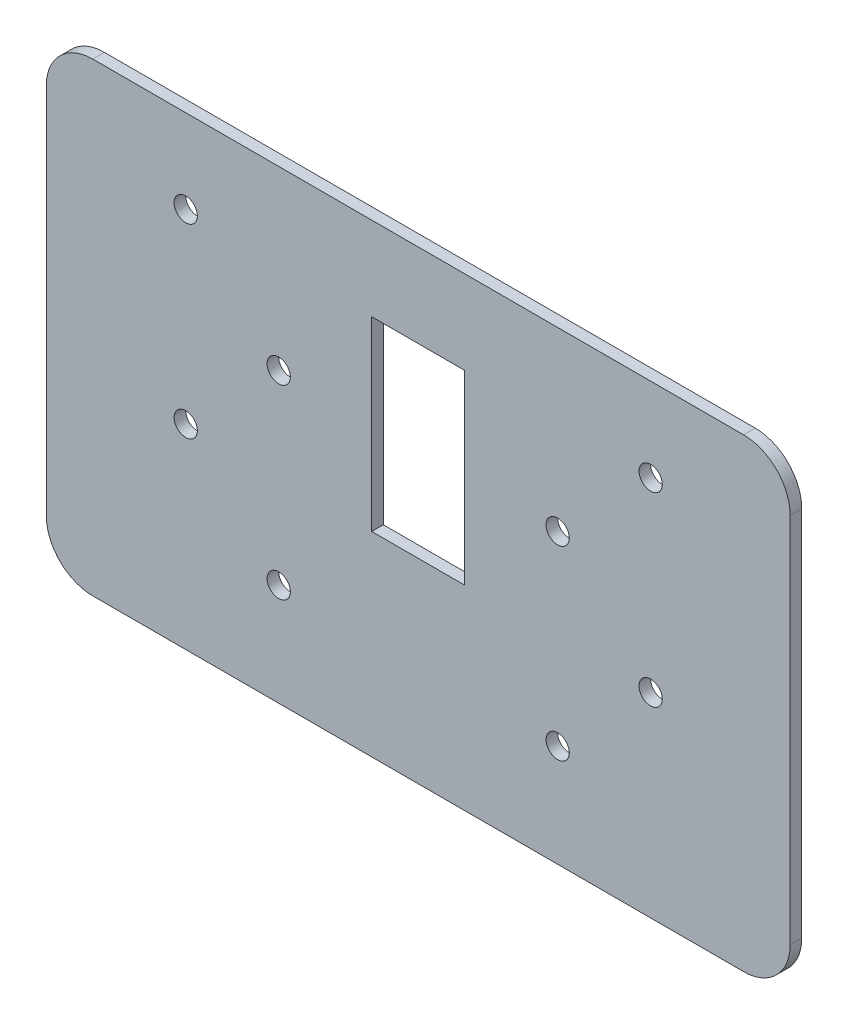
ISO-10303-21;
HEADER;
FILE_DESCRIPTION(('STEP AP214'),'2;1');
FILE_NAME('part.step','',(''),(''),'','','');
FILE_SCHEMA(('AUTOMOTIVE_DESIGN { 1 0 10303 214 1 1 1 1 }'));
ENDSEC;
DATA;
#1=APPLICATION_CONTEXT('core data for automotive mechanical design processes');
#2=APPLICATION_PROTOCOL_DEFINITION('international standard','automotive_design',2000,#1);
#3=PRODUCT_CONTEXT('',#1,'mechanical');
#4=PRODUCT('Part','Part','',(#3));
#5=PRODUCT_RELATED_PRODUCT_CATEGORY('part','',(#4));
#6=PRODUCT_DEFINITION_FORMATION('','',#4);
#7=PRODUCT_DEFINITION_CONTEXT('part definition',#1,'design');
#8=PRODUCT_DEFINITION('design','',#6,#7);
#9=PRODUCT_DEFINITION_SHAPE('','',#8);
#10=(LENGTH_UNIT() NAMED_UNIT(*) SI_UNIT(.MILLI.,.METRE.));
#11=(NAMED_UNIT(*) PLANE_ANGLE_UNIT() SI_UNIT($,.RADIAN.));
#12=(NAMED_UNIT(*) SI_UNIT($,.STERADIAN.) SOLID_ANGLE_UNIT());
#13=UNCERTAINTY_MEASURE_WITH_UNIT(LENGTH_MEASURE(1.E-05),#10,'distance_accuracy_value','');
#14=(GEOMETRIC_REPRESENTATION_CONTEXT(3) GLOBAL_UNCERTAINTY_ASSIGNED_CONTEXT((#13)) GLOBAL_UNIT_ASSIGNED_CONTEXT((#10,
#11,#12)) REPRESENTATION_CONTEXT('',''));
#15=CARTESIAN_POINT('',(0.,0.,0.));
#16=DIRECTION('',(0.,0.,1.));
#17=DIRECTION('',(1.,0.,0.));
#18=AXIS2_PLACEMENT_3D('',#15,#16,#17);
#19=CARTESIAN_POINT('',(0.,454.630831077748,3.175));
#20=DIRECTION('',(0.,1.,0.));
#21=DIRECTION('',(0.,0.,1.));
#22=AXIS2_PLACEMENT_3D('',#19,#20,#21);
#23=PLANE('',#22);
#24=DIRECTION('',(1.,0.,0.));
#25=VECTOR('',#24,1.);
#26=CARTESIAN_POINT('',(0.,454.630831077748,0.));
#27=LINE('',#26,#25);
#28=CARTESIAN_POINT('',(214.219369125784,454.630831077748,0.));
#29=VERTEX_POINT('',#28);
#30=CARTESIAN_POINT('',(392.019369125783,454.630831077748,0.));
#31=VERTEX_POINT('',#30);
#32=EDGE_CURVE('E196',#29,#31,#27,.T.);
#33=ORIENTED_EDGE('',*,*,#32,.F.);
#34=DIRECTION('',(0.,0.,-1.));
#35=VECTOR('',#34,1.);
#36=CARTESIAN_POINT('',(214.219369125784,454.630831077748,3.175));
#37=LINE('',#36,#35);
#38=CARTESIAN_POINT('',(214.219369125784,454.630831077748,3.175));
#39=VERTEX_POINT('',#38);
#40=EDGE_CURVE('E11',#39,#29,#37,.T.);
#41=ORIENTED_EDGE('',*,*,#40,.F.);
#42=DIRECTION('',(1.,0.,0.));
#43=VECTOR('',#42,1.);
#44=CARTESIAN_POINT('',(0.,454.630831077748,3.175));
#45=LINE('',#44,#43);
#46=CARTESIAN_POINT('',(392.019369125783,454.630831077748,3.175));
#47=VERTEX_POINT('',#46);
#48=EDGE_CURVE('E282',#39,#47,#45,.T.);
#49=ORIENTED_EDGE('',*,*,#48,.T.);
#50=DIRECTION('',(0.,0.,-1.));
#51=VECTOR('',#50,1.);
#52=CARTESIAN_POINT('',(392.019369125783,454.630831077748,3.175));
#53=LINE('',#52,#51);
#54=EDGE_CURVE('E54',#47,#31,#53,.T.);
#55=ORIENTED_EDGE('',*,*,#54,.T.);
#56=EDGE_LOOP('',(#33,#41,#49,#55));
#57=FACE_BOUND('',#56,.T.);
#58=ADVANCED_FACE('F35',(#57),#23,.T.);
#59=CARTESIAN_POINT('',(214.219369125784,441.930831077748,3.175));
#60=DIRECTION('',(0.,0.,-1.));
#61=DIRECTION('',(-1.,0.,0.));
#62=AXIS2_PLACEMENT_3D('',#59,#60,#61);
#63=CYLINDRICAL_SURFACE('',#62,12.7);
#64=CARTESIAN_POINT('',(214.219369125784,441.930831077748,0.));
#65=DIRECTION('',(0.,0.,1.));
#66=DIRECTION('',(1.,0.,0.));
#67=AXIS2_PLACEMENT_3D('',#64,#65,#66);
#68=CIRCLE('',#67,12.7);
#69=CARTESIAN_POINT('',(201.519369125784,441.930831077748,0.));
#70=VERTEX_POINT('',#69);
#71=EDGE_CURVE('E198',#29,#70,#68,.T.);
#72=ORIENTED_EDGE('',*,*,#71,.T.);
#73=DIRECTION('',(0.,0.,-1.));
#74=VECTOR('',#73,1.);
#75=CARTESIAN_POINT('',(201.519369125784,441.930831077748,3.175));
#76=LINE('',#75,#74);
#77=CARTESIAN_POINT('',(201.519369125784,441.930831077748,3.175));
#78=VERTEX_POINT('',#77);
#79=EDGE_CURVE('E45',#78,#70,#76,.T.);
#80=ORIENTED_EDGE('',*,*,#79,.F.);
#81=CARTESIAN_POINT('',(214.219369125784,441.930831077748,3.175));
#82=DIRECTION('',(0.,0.,1.));
#83=DIRECTION('',(1.,0.,0.));
#84=AXIS2_PLACEMENT_3D('',#81,#82,#83);
#85=CIRCLE('',#84,12.7);
#86=EDGE_CURVE('E284',#39,#78,#85,.T.);
#87=ORIENTED_EDGE('',*,*,#86,.F.);
#88=ORIENTED_EDGE('',*,*,#40,.T.);
#89=EDGE_LOOP('',(#72,#80,#87,#88));
#90=FACE_BOUND('',#89,.T.);
#91=ADVANCED_FACE('F317',(#90),#63,.T.);
#92=CARTESIAN_POINT('',(201.519369125784,0.,3.175));
#93=DIRECTION('',(1.,0.,0.));
#94=DIRECTION('',(0.,1.,0.));
#95=AXIS2_PLACEMENT_3D('',#92,#93,#94);
#96=PLANE('',#95);
#97=DIRECTION('',(0.,-1.,0.));
#98=VECTOR('',#97,1.);
#99=CARTESIAN_POINT('',(201.519369125784,0.,0.));
#100=LINE('',#99,#98);
#101=CARTESIAN_POINT('',(201.519369125784,340.330831077748,0.));
#102=VERTEX_POINT('',#101);
#103=EDGE_CURVE('E201',#70,#102,#100,.T.);
#104=ORIENTED_EDGE('',*,*,#103,.T.);
#105=DIRECTION('',(0.,0.,-1.));
#106=VECTOR('',#105,1.);
#107=CARTESIAN_POINT('',(201.519369125784,340.330831077748,3.175));
#108=LINE('',#107,#106);
#109=CARTESIAN_POINT('',(201.519369125784,340.330831077748,3.175));
#110=VERTEX_POINT('',#109);
#111=EDGE_CURVE('E235',#110,#102,#108,.T.);
#112=ORIENTED_EDGE('',*,*,#111,.F.);
#113=DIRECTION('',(0.,-1.,0.));
#114=VECTOR('',#113,1.);
#115=CARTESIAN_POINT('',(201.519369125784,0.,3.175));
#116=LINE('',#115,#114);
#117=EDGE_CURVE('E287',#78,#110,#116,.T.);
#118=ORIENTED_EDGE('',*,*,#117,.F.);
#119=ORIENTED_EDGE('',*,*,#79,.T.);
#120=EDGE_LOOP('',(#104,#112,#118,#119));
#121=FACE_BOUND('',#120,.T.);
#122=ADVANCED_FACE('F322',(#121),#96,.F.);
#123=CARTESIAN_POINT('',(214.219369125784,340.330831077748,3.175));
#124=DIRECTION('',(0.,0.,-1.));
#125=DIRECTION('',(-1.,0.,0.));
#126=AXIS2_PLACEMENT_3D('',#123,#124,#125);
#127=CYLINDRICAL_SURFACE('',#126,12.7);
#128=CARTESIAN_POINT('',(214.219369125784,340.330831077748,0.));
#129=DIRECTION('',(0.,0.,1.));
#130=DIRECTION('',(1.,0.,0.));
#131=AXIS2_PLACEMENT_3D('',#128,#129,#130);
#132=CIRCLE('',#131,12.7);
#133=CARTESIAN_POINT('',(214.219369125784,327.630831077748,0.));
#134=VERTEX_POINT('',#133);
#135=EDGE_CURVE('E204',#102,#134,#132,.T.);
#136=ORIENTED_EDGE('',*,*,#135,.T.);
#137=DIRECTION('',(0.,0.,-1.));
#138=VECTOR('',#137,1.);
#139=CARTESIAN_POINT('',(214.219369125784,327.630831077748,3.175));
#140=LINE('',#139,#138);
#141=CARTESIAN_POINT('',(214.219369125784,327.630831077748,3.175));
#142=VERTEX_POINT('',#141);
#143=EDGE_CURVE('E232',#142,#134,#140,.T.);
#144=ORIENTED_EDGE('',*,*,#143,.F.);
#145=CARTESIAN_POINT('',(214.219369125784,340.330831077748,3.175));
#146=DIRECTION('',(0.,0.,1.));
#147=DIRECTION('',(1.,0.,0.));
#148=AXIS2_PLACEMENT_3D('',#145,#146,#147);
#149=CIRCLE('',#148,12.7);
#150=EDGE_CURVE('E290',#110,#142,#149,.T.);
#151=ORIENTED_EDGE('',*,*,#150,.F.);
#152=ORIENTED_EDGE('',*,*,#111,.T.);
#153=EDGE_LOOP('',(#136,#144,#151,#152));
#154=FACE_BOUND('',#153,.T.);
#155=ADVANCED_FACE('F294',(#154),#127,.T.);
#156=CARTESIAN_POINT('',(0.,327.630831077748,3.175));
#157=DIRECTION('',(0.,1.,0.));
#158=DIRECTION('',(0.,0.,1.));
#159=AXIS2_PLACEMENT_3D('',#156,#157,#158);
#160=PLANE('',#159);
#161=DIRECTION('',(1.,0.,0.));
#162=VECTOR('',#161,1.);
#163=CARTESIAN_POINT('',(0.,327.630831077748,0.));
#164=LINE('',#163,#162);
#165=CARTESIAN_POINT('',(392.019369125783,327.630831077748,0.));
#166=VERTEX_POINT('',#165);
#167=EDGE_CURVE('E207',#134,#166,#164,.T.);
#168=ORIENTED_EDGE('',*,*,#167,.T.);
#169=DIRECTION('',(0.,0.,-1.));
#170=VECTOR('',#169,1.);
#171=CARTESIAN_POINT('',(392.019369125783,327.630831077748,3.175));
#172=LINE('',#171,#170);
#173=CARTESIAN_POINT('',(392.019369125783,327.630831077748,3.175));
#174=VERTEX_POINT('',#173);
#175=EDGE_CURVE('E151',#174,#166,#172,.T.);
#176=ORIENTED_EDGE('',*,*,#175,.F.);
#177=DIRECTION('',(1.,0.,0.));
#178=VECTOR('',#177,1.);
#179=CARTESIAN_POINT('',(0.,327.630831077748,3.175));
#180=LINE('',#179,#178);
#181=EDGE_CURVE('E140',#142,#174,#180,.T.);
#182=ORIENTED_EDGE('',*,*,#181,.F.);
#183=ORIENTED_EDGE('',*,*,#143,.T.);
#184=EDGE_LOOP('',(#168,#176,#182,#183));
#185=FACE_BOUND('',#184,.T.);
#186=ADVANCED_FACE('F296',(#185),#160,.F.);
#187=CARTESIAN_POINT('',(392.019369125784,340.330831077748,3.175));
#188=DIRECTION('',(0.,0.,-1.));
#189=DIRECTION('',(-1.,0.,0.));
#190=AXIS2_PLACEMENT_3D('',#187,#188,#189);
#191=CYLINDRICAL_SURFACE('',#190,12.7);
#192=CARTESIAN_POINT('',(392.019369125784,340.330831077748,0.));
#193=DIRECTION('',(0.,0.,1.));
#194=DIRECTION('',(1.,0.,0.));
#195=AXIS2_PLACEMENT_3D('',#192,#193,#194);
#196=CIRCLE('',#195,12.7);
#197=CARTESIAN_POINT('',(404.719369125784,340.330831077748,0.));
#198=VERTEX_POINT('',#197);
#199=EDGE_CURVE('E148',#166,#198,#196,.T.);
#200=ORIENTED_EDGE('',*,*,#199,.T.);
#201=DIRECTION('',(0.,0.,-1.));
#202=VECTOR('',#201,1.);
#203=CARTESIAN_POINT('',(404.719369125784,340.330831077748,3.175));
#204=LINE('',#203,#202);
#205=CARTESIAN_POINT('',(404.719369125784,340.330831077748,3.175));
#206=VERTEX_POINT('',#205);
#207=EDGE_CURVE('E146',#206,#198,#204,.T.);
#208=ORIENTED_EDGE('',*,*,#207,.F.);
#209=CARTESIAN_POINT('',(392.019369125784,340.330831077748,3.175));
#210=DIRECTION('',(0.,0.,1.));
#211=DIRECTION('',(1.,0.,0.));
#212=AXIS2_PLACEMENT_3D('',#209,#210,#211);
#213=CIRCLE('',#212,12.7);
#214=EDGE_CURVE('E131',#174,#206,#213,.T.);
#215=ORIENTED_EDGE('',*,*,#214,.F.);
#216=ORIENTED_EDGE('',*,*,#175,.T.);
#217=EDGE_LOOP('',(#200,#208,#215,#216));
#218=FACE_BOUND('',#217,.T.);
#219=ADVANCED_FACE('F147',(#218),#191,.T.);
#220=CARTESIAN_POINT('',(404.719369125784,0.,3.175));
#221=DIRECTION('',(1.,0.,0.));
#222=DIRECTION('',(0.,0.,-1.));
#223=AXIS2_PLACEMENT_3D('',#220,#221,#222);
#224=PLANE('',#223);
#225=DIRECTION('',(0.,-1.,0.));
#226=VECTOR('',#225,1.);
#227=CARTESIAN_POINT('',(404.719369125784,0.,0.));
#228=LINE('',#227,#226);
#229=CARTESIAN_POINT('',(404.719369125784,441.930831077748,0.));
#230=VERTEX_POINT('',#229);
#231=EDGE_CURVE('E211',#230,#198,#228,.T.);
#232=ORIENTED_EDGE('',*,*,#231,.F.);
#233=DIRECTION('',(0.,0.,-1.));
#234=VECTOR('',#233,1.);
#235=CARTESIAN_POINT('',(404.719369125784,441.930831077748,3.175));
#236=LINE('',#235,#234);
#237=CARTESIAN_POINT('',(404.719369125784,441.930831077748,3.175));
#238=VERTEX_POINT('',#237);
#239=EDGE_CURVE('E91',#238,#230,#236,.T.);
#240=ORIENTED_EDGE('',*,*,#239,.F.);
#241=DIRECTION('',(0.,-1.,0.));
#242=VECTOR('',#241,1.);
#243=CARTESIAN_POINT('',(404.719369125784,0.,3.175));
#244=LINE('',#243,#242);
#245=EDGE_CURVE('E138',#238,#206,#244,.T.);
#246=ORIENTED_EDGE('',*,*,#245,.T.);
#247=ORIENTED_EDGE('',*,*,#207,.T.);
#248=EDGE_LOOP('',(#232,#240,#246,#247));
#249=FACE_BOUND('',#248,.T.);
#250=ADVANCED_FACE('F153',(#249),#224,.T.);
#251=CARTESIAN_POINT('',(290.419369125784,0.,3.175));
#252=DIRECTION('',(1.,0.,0.));
#253=DIRECTION('',(0.,0.,-1.));
#254=AXIS2_PLACEMENT_3D('',#251,#252,#253);
#255=PLANE('',#254);
#256=DIRECTION('',(0.,-1.,0.));
#257=VECTOR('',#256,1.);
#258=CARTESIAN_POINT('',(290.419369125784,0.,0.));
#259=LINE('',#258,#257);
#260=CARTESIAN_POINT('',(290.419369125784,431.770831077748,0.));
#261=VERTEX_POINT('',#260);
#262=CARTESIAN_POINT('',(290.419369125784,380.970831077748,0.));
#263=VERTEX_POINT('',#262);
#264=EDGE_CURVE('E172',#261,#263,#259,.T.);
#265=ORIENTED_EDGE('',*,*,#264,.F.);
#266=DIRECTION('',(0.,0.,-1.));
#267=VECTOR('',#266,1.);
#268=CARTESIAN_POINT('',(290.419369125784,431.770831077748,3.175));
#269=LINE('',#268,#267);
#270=CARTESIAN_POINT('',(290.419369125784,431.770831077748,3.175));
#271=VERTEX_POINT('',#270);
#272=EDGE_CURVE('E39',#271,#261,#269,.T.);
#273=ORIENTED_EDGE('',*,*,#272,.F.);
#274=DIRECTION('',(0.,-1.,0.));
#275=VECTOR('',#274,1.);
#276=CARTESIAN_POINT('',(290.419369125784,0.,3.175));
#277=LINE('',#276,#275);
#278=CARTESIAN_POINT('',(290.419369125784,380.970831077748,3.175));
#279=VERTEX_POINT('',#278);
#280=EDGE_CURVE('E228',#271,#279,#277,.T.);
#281=ORIENTED_EDGE('',*,*,#280,.T.);
#282=DIRECTION('',(0.,0.,-1.));
#283=VECTOR('',#282,1.);
#284=CARTESIAN_POINT('',(290.419369125784,380.970831077748,3.175));
#285=LINE('',#284,#283);
#286=EDGE_CURVE('E171',#279,#263,#285,.T.);
#287=ORIENTED_EDGE('',*,*,#286,.T.);
#288=EDGE_LOOP('',(#265,#273,#281,#287));
#289=FACE_BOUND('',#288,.T.);
#290=ADVANCED_FACE('F37',(#289),#255,.T.);
#291=CARTESIAN_POINT('',(0.,431.770831077748,3.175));
#292=DIRECTION('',(0.,-1.,0.));
#293=DIRECTION('',(0.,0.,-1.));
#294=AXIS2_PLACEMENT_3D('',#291,#292,#293);
#295=PLANE('',#294);
#296=DIRECTION('',(-1.,0.,0.));
#297=VECTOR('',#296,1.);
#298=CARTESIAN_POINT('',(0.,431.770831077748,0.));
#299=LINE('',#298,#297);
#300=CARTESIAN_POINT('',(315.819369125784,431.770831077748,0.));
#301=VERTEX_POINT('',#300);
#302=EDGE_CURVE('E175',#301,#261,#299,.T.);
#303=ORIENTED_EDGE('',*,*,#302,.F.);
#304=DIRECTION('',(0.,0.,-1.));
#305=VECTOR('',#304,1.);
#306=CARTESIAN_POINT('',(315.819369125784,431.770831077748,3.175));
#307=LINE('',#306,#305);
#308=CARTESIAN_POINT('',(315.819369125784,431.770831077748,3.175));
#309=VERTEX_POINT('',#308);
#310=EDGE_CURVE('E242',#309,#301,#307,.T.);
#311=ORIENTED_EDGE('',*,*,#310,.F.);
#312=DIRECTION('',(-1.,0.,0.));
#313=VECTOR('',#312,1.);
#314=CARTESIAN_POINT('',(0.,431.770831077748,3.175));
#315=LINE('',#314,#313);
#316=EDGE_CURVE('E251',#309,#271,#315,.T.);
#317=ORIENTED_EDGE('',*,*,#316,.T.);
#318=ORIENTED_EDGE('',*,*,#272,.T.);
#319=EDGE_LOOP('',(#303,#311,#317,#318));
#320=FACE_BOUND('',#319,.T.);
#321=ADVANCED_FACE('F249',(#320),#295,.T.);
#322=CARTESIAN_POINT('',(315.819369125784,0.,3.175));
#323=DIRECTION('',(-1.,0.,0.));
#324=DIRECTION('',(0.,0.,1.));
#325=AXIS2_PLACEMENT_3D('',#322,#323,#324);
#326=PLANE('',#325);
#327=DIRECTION('',(0.,1.,0.));
#328=VECTOR('',#327,1.);
#329=CARTESIAN_POINT('',(315.819369125784,0.,0.));
#330=LINE('',#329,#328);
#331=CARTESIAN_POINT('',(315.819369125784,380.970831077748,0.));
#332=VERTEX_POINT('',#331);
#333=EDGE_CURVE('E178',#332,#301,#330,.T.);
#334=ORIENTED_EDGE('',*,*,#333,.F.);
#335=DIRECTION('',(0.,0.,-1.));
#336=VECTOR('',#335,1.);
#337=CARTESIAN_POINT('',(315.819369125784,380.970831077748,3.175));
#338=LINE('',#337,#336);
#339=CARTESIAN_POINT('',(315.819369125784,380.970831077748,3.175));
#340=VERTEX_POINT('',#339);
#341=EDGE_CURVE('E241',#340,#332,#338,.T.);
#342=ORIENTED_EDGE('',*,*,#341,.F.);
#343=DIRECTION('',(0.,1.,0.));
#344=VECTOR('',#343,1.);
#345=CARTESIAN_POINT('',(315.819369125784,0.,3.175));
#346=LINE('',#345,#344);
#347=EDGE_CURVE('E258',#340,#309,#346,.T.);
#348=ORIENTED_EDGE('',*,*,#347,.T.);
#349=ORIENTED_EDGE('',*,*,#310,.T.);
#350=EDGE_LOOP('',(#334,#342,#348,#349));
#351=FACE_BOUND('',#350,.T.);
#352=ADVANCED_FACE('F256',(#351),#326,.T.);
#353=CARTESIAN_POINT('',(239.619369125784,431.770831077748,3.175));
#354=DIRECTION('',(0.,0.,-1.));
#355=DIRECTION('',(-1.,0.,0.));
#356=AXIS2_PLACEMENT_3D('',#353,#354,#355);
#357=CYLINDRICAL_SURFACE('',#356,3.17499999999997);
#358=CARTESIAN_POINT('',(239.619369125784,431.770831077748,3.175));
#359=DIRECTION('',(0.,0.,1.));
#360=DIRECTION('',(1.,0.,0.));
#361=AXIS2_PLACEMENT_3D('',#358,#359,#360);
#362=CIRCLE('',#361,3.17499999999997);
#363=CARTESIAN_POINT('',(242.794369125784,431.770831077748,3.175));
#364=VERTEX_POINT('',#363);
#365=EDGE_CURVE('E165',#364,#364,#362,.T.);
#366=ORIENTED_EDGE('',*,*,#365,.T.);
#367=EDGE_LOOP('',(#366));
#368=FACE_BOUND('',#367,.T.);
#369=CARTESIAN_POINT('',(239.619369125784,431.770831077748,0.));
#370=DIRECTION('',(0.,0.,1.));
#371=DIRECTION('',(1.,0.,0.));
#372=AXIS2_PLACEMENT_3D('',#369,#370,#371);
#373=CIRCLE('',#372,3.17499999999997);
#374=CARTESIAN_POINT('',(242.794369125784,431.770831077748,0.));
#375=VERTEX_POINT('',#374);
#376=EDGE_CURVE('E222',#375,#375,#373,.T.);
#377=ORIENTED_EDGE('',*,*,#376,.F.);
#378=EDGE_LOOP('',(#377));
#379=FACE_BOUND('',#378,.T.);
#380=ADVANCED_FACE('F342',(#368,#379),#357,.F.);
#381=CARTESIAN_POINT('',(239.619369125784,380.970831077748,3.175));
#382=DIRECTION('',(0.,0.,-1.));
#383=DIRECTION('',(-1.,0.,0.));
#384=AXIS2_PLACEMENT_3D('',#381,#382,#383);
#385=CYLINDRICAL_SURFACE('',#384,3.17499999999997);
#386=CARTESIAN_POINT('',(239.619369125784,380.970831077748,3.175));
#387=DIRECTION('',(0.,0.,1.));
#388=DIRECTION('',(1.,0.,0.));
#389=AXIS2_PLACEMENT_3D('',#386,#387,#388);
#390=CIRCLE('',#389,3.17499999999997);
#391=CARTESIAN_POINT('',(242.794369125784,380.970831077748,3.175));
#392=VERTEX_POINT('',#391);
#393=EDGE_CURVE('E162',#392,#392,#390,.T.);
#394=ORIENTED_EDGE('',*,*,#393,.T.);
#395=EDGE_LOOP('',(#394));
#396=FACE_BOUND('',#395,.T.);
#397=CARTESIAN_POINT('',(239.619369125784,380.970831077748,0.));
#398=DIRECTION('',(0.,0.,1.));
#399=DIRECTION('',(1.,0.,0.));
#400=AXIS2_PLACEMENT_3D('',#397,#398,#399);
#401=CIRCLE('',#400,3.17499999999997);
#402=CARTESIAN_POINT('',(242.794369125784,380.970831077748,0.));
#403=VERTEX_POINT('',#402);
#404=EDGE_CURVE('E219',#403,#403,#401,.T.);
#405=ORIENTED_EDGE('',*,*,#404,.F.);
#406=EDGE_LOOP('',(#405));
#407=FACE_BOUND('',#406,.T.);
#408=ADVANCED_FACE('F312',(#396,#407),#385,.F.);
#409=CARTESIAN_POINT('',(265.019369125761,355.570831077745,3.175));
#410=DIRECTION('',(0.,0.,-1.));
#411=DIRECTION('',(-1.,0.,0.));
#412=AXIS2_PLACEMENT_3D('',#409,#410,#411);
#413=CYLINDRICAL_SURFACE('',#412,3.17500000000002);
#414=CARTESIAN_POINT('',(265.019369125761,355.570831077745,3.175));
#415=DIRECTION('',(0.,0.,1.));
#416=DIRECTION('',(1.,0.,0.));
#417=AXIS2_PLACEMENT_3D('',#414,#415,#416);
#418=CIRCLE('',#417,3.17500000000002);
#419=CARTESIAN_POINT('',(268.194369125761,355.570831077745,3.175));
#420=VERTEX_POINT('',#419);
#421=EDGE_CURVE('E156',#420,#420,#418,.T.);
#422=ORIENTED_EDGE('',*,*,#421,.T.);
#423=EDGE_LOOP('',(#422));
#424=FACE_BOUND('',#423,.T.);
#425=CARTESIAN_POINT('',(265.019369125761,355.570831077745,0.));
#426=DIRECTION('',(0.,0.,1.));
#427=DIRECTION('',(1.,0.,0.));
#428=AXIS2_PLACEMENT_3D('',#425,#426,#427);
#429=CIRCLE('',#428,3.17500000000002);
#430=CARTESIAN_POINT('',(268.194369125761,355.570831077745,0.));
#431=VERTEX_POINT('',#430);
#432=EDGE_CURVE('E216',#431,#431,#429,.T.);
#433=ORIENTED_EDGE('',*,*,#432,.F.);
#434=EDGE_LOOP('',(#433));
#435=FACE_BOUND('',#434,.T.);
#436=ADVANCED_FACE('F303',(#424,#435),#413,.F.);
#437=CARTESIAN_POINT('',(392.019369125784,441.930831077748,3.175));
#438=DIRECTION('',(0.,0.,-1.));
#439=DIRECTION('',(-1.,0.,0.));
#440=AXIS2_PLACEMENT_3D('',#437,#438,#439);
#441=CYLINDRICAL_SURFACE('',#440,12.7);
#442=CARTESIAN_POINT('',(392.019369125784,441.930831077748,0.));
#443=DIRECTION('',(0.,0.,1.));
#444=DIRECTION('',(1.,0.,0.));
#445=AXIS2_PLACEMENT_3D('',#442,#443,#444);
#446=CIRCLE('',#445,12.7);
#447=EDGE_CURVE('E213',#31,#230,#446,.F.);
#448=ORIENTED_EDGE('',*,*,#447,.F.);
#449=ORIENTED_EDGE('',*,*,#54,.F.);
#450=CARTESIAN_POINT('',(392.019369125784,441.930831077748,3.175));
#451=DIRECTION('',(0.,0.,1.));
#452=DIRECTION('',(1.,0.,0.));
#453=AXIS2_PLACEMENT_3D('',#450,#451,#452);
#454=CIRCLE('',#453,12.7);
#455=EDGE_CURVE('E154',#47,#238,#454,.F.);
#456=ORIENTED_EDGE('',*,*,#455,.T.);
#457=ORIENTED_EDGE('',*,*,#239,.T.);
#458=EDGE_LOOP('',(#448,#449,#456,#457));
#459=FACE_BOUND('',#458,.T.);
#460=ADVANCED_FACE('F300',(#459),#441,.T.);
#461=CARTESIAN_POINT('',(341.21936912576,355.570831077744,3.175));
#462=DIRECTION('',(0.,0.,-1.));
#463=DIRECTION('',(-1.,0.,0.));
#464=AXIS2_PLACEMENT_3D('',#461,#462,#463);
#465=CYLINDRICAL_SURFACE('',#464,3.17500000000002);
#466=CARTESIAN_POINT('',(341.21936912576,355.570831077744,3.175));
#467=DIRECTION('',(0.,0.,1.));
#468=DIRECTION('',(1.,0.,0.));
#469=AXIS2_PLACEMENT_3D('',#466,#467,#468);
#470=CIRCLE('',#469,3.17500000000002);
#471=CARTESIAN_POINT('',(344.39436912576,355.570831077744,3.175));
#472=VERTEX_POINT('',#471);
#473=EDGE_CURVE('E279',#472,#472,#470,.T.);
#474=ORIENTED_EDGE('',*,*,#473,.T.);
#475=EDGE_LOOP('',(#474));
#476=FACE_BOUND('',#475,.T.);
#477=CARTESIAN_POINT('',(341.21936912576,355.570831077744,0.));
#478=DIRECTION('',(0.,0.,1.));
#479=DIRECTION('',(1.,0.,0.));
#480=AXIS2_PLACEMENT_3D('',#477,#478,#479);
#481=CIRCLE('',#480,3.17500000000002);
#482=CARTESIAN_POINT('',(344.39436912576,355.570831077744,0.));
#483=VERTEX_POINT('',#482);
#484=EDGE_CURVE('E193',#483,#483,#481,.T.);
#485=ORIENTED_EDGE('',*,*,#484,.F.);
#486=EDGE_LOOP('',(#485));
#487=FACE_BOUND('',#486,.T.);
#488=ADVANCED_FACE('F302',(#476,#487),#465,.F.);
#489=CARTESIAN_POINT('',(366.619369125784,431.770831077748,3.175));
#490=DIRECTION('',(0.,0.,-1.));
#491=DIRECTION('',(-1.,0.,0.));
#492=AXIS2_PLACEMENT_3D('',#489,#490,#491);
#493=CYLINDRICAL_SURFACE('',#492,3.17499999999997);
#494=CARTESIAN_POINT('',(366.619369125784,431.770831077748,3.175));
#495=DIRECTION('',(0.,0.,1.));
#496=DIRECTION('',(1.,0.,0.));
#497=AXIS2_PLACEMENT_3D('',#494,#495,#496);
#498=CIRCLE('',#497,3.17499999999997);
#499=CARTESIAN_POINT('',(369.794369125784,431.770831077748,3.175));
#500=VERTEX_POINT('',#499);
#501=EDGE_CURVE('E276',#500,#500,#498,.T.);
#502=ORIENTED_EDGE('',*,*,#501,.T.);
#503=EDGE_LOOP('',(#502));
#504=FACE_BOUND('',#503,.T.);
#505=CARTESIAN_POINT('',(366.619369125784,431.770831077748,0.));
#506=DIRECTION('',(0.,0.,1.));
#507=DIRECTION('',(1.,0.,0.));
#508=AXIS2_PLACEMENT_3D('',#505,#506,#507);
#509=CIRCLE('',#508,3.17499999999997);
#510=CARTESIAN_POINT('',(369.794369125784,431.770831077748,0.));
#511=VERTEX_POINT('',#510);
#512=EDGE_CURVE('E190',#511,#511,#509,.T.);
#513=ORIENTED_EDGE('',*,*,#512,.F.);
#514=EDGE_LOOP('',(#513));
#515=FACE_BOUND('',#514,.T.);
#516=ADVANCED_FACE('F309',(#504,#515),#493,.F.);
#517=CARTESIAN_POINT('',(341.219369125784,406.370831077748,3.175));
#518=DIRECTION('',(0.,0.,-1.));
#519=DIRECTION('',(-1.,0.,0.));
#520=AXIS2_PLACEMENT_3D('',#517,#518,#519);
#521=CYLINDRICAL_SURFACE('',#520,3.17499999999997);
#522=CARTESIAN_POINT('',(341.219369125784,406.370831077748,3.175));
#523=DIRECTION('',(0.,0.,1.));
#524=DIRECTION('',(1.,0.,0.));
#525=AXIS2_PLACEMENT_3D('',#522,#523,#524);
#526=CIRCLE('',#525,3.17499999999997);
#527=CARTESIAN_POINT('',(344.394369125784,406.370831077748,3.175));
#528=VERTEX_POINT('',#527);
#529=EDGE_CURVE('E270',#528,#528,#526,.T.);
#530=ORIENTED_EDGE('',*,*,#529,.T.);
#531=EDGE_LOOP('',(#530));
#532=FACE_BOUND('',#531,.T.);
#533=CARTESIAN_POINT('',(341.219369125784,406.370831077748,0.));
#534=DIRECTION('',(0.,0.,1.));
#535=DIRECTION('',(1.,0.,0.));
#536=AXIS2_PLACEMENT_3D('',#533,#534,#535);
#537=CIRCLE('',#536,3.17499999999997);
#538=CARTESIAN_POINT('',(344.394369125784,406.370831077748,0.));
#539=VERTEX_POINT('',#538);
#540=EDGE_CURVE('E187',#539,#539,#537,.T.);
#541=ORIENTED_EDGE('',*,*,#540,.F.);
#542=EDGE_LOOP('',(#541));
#543=FACE_BOUND('',#542,.T.);
#544=ADVANCED_FACE('F329',(#532,#543),#521,.F.);
#545=CARTESIAN_POINT('',(366.619369125784,380.970831077748,3.175));
#546=DIRECTION('',(0.,0.,-1.));
#547=DIRECTION('',(-1.,0.,0.));
#548=AXIS2_PLACEMENT_3D('',#545,#546,#547);
#549=CYLINDRICAL_SURFACE('',#548,3.17499999999997);
#550=CARTESIAN_POINT('',(366.619369125784,380.970831077748,3.175));
#551=DIRECTION('',(0.,0.,1.));
#552=DIRECTION('',(1.,0.,0.));
#553=AXIS2_PLACEMENT_3D('',#550,#551,#552);
#554=CIRCLE('',#553,3.17499999999997);
#555=CARTESIAN_POINT('',(369.794369125784,380.970831077748,3.175));
#556=VERTEX_POINT('',#555);
#557=EDGE_CURVE('E267',#556,#556,#554,.T.);
#558=ORIENTED_EDGE('',*,*,#557,.T.);
#559=EDGE_LOOP('',(#558));
#560=FACE_BOUND('',#559,.T.);
#561=CARTESIAN_POINT('',(366.619369125784,380.970831077748,0.));
#562=DIRECTION('',(0.,0.,1.));
#563=DIRECTION('',(1.,0.,0.));
#564=AXIS2_PLACEMENT_3D('',#561,#562,#563);
#565=CIRCLE('',#564,3.17499999999997);
#566=CARTESIAN_POINT('',(369.794369125784,380.970831077748,0.));
#567=VERTEX_POINT('',#566);
#568=EDGE_CURVE('E184',#567,#567,#565,.T.);
#569=ORIENTED_EDGE('',*,*,#568,.F.);
#570=EDGE_LOOP('',(#569));
#571=FACE_BOUND('',#570,.T.);
#572=ADVANCED_FACE('F333',(#560,#571),#549,.F.);
#573=CARTESIAN_POINT('',(0.,380.970831077748,3.175));
#574=DIRECTION('',(0.,1.,0.));
#575=DIRECTION('',(0.,0.,1.));
#576=AXIS2_PLACEMENT_3D('',#573,#574,#575);
#577=PLANE('',#576);
#578=DIRECTION('',(1.,0.,0.));
#579=VECTOR('',#578,1.);
#580=CARTESIAN_POINT('',(0.,380.970831077748,0.));
#581=LINE('',#580,#579);
#582=EDGE_CURVE('E181',#263,#332,#581,.T.);
#583=ORIENTED_EDGE('',*,*,#582,.F.);
#584=ORIENTED_EDGE('',*,*,#286,.F.);
#585=DIRECTION('',(1.,0.,0.));
#586=VECTOR('',#585,1.);
#587=CARTESIAN_POINT('',(0.,380.970831077748,3.175));
#588=LINE('',#587,#586);
#589=EDGE_CURVE('E264',#279,#340,#588,.T.);
#590=ORIENTED_EDGE('',*,*,#589,.T.);
#591=ORIENTED_EDGE('',*,*,#341,.T.);
#592=EDGE_LOOP('',(#583,#584,#590,#591));
#593=FACE_BOUND('',#592,.T.);
#594=ADVANCED_FACE('F266',(#593),#577,.T.);
#595=CARTESIAN_POINT('',(265.019369125783,406.370831077748,3.175));
#596=DIRECTION('',(0.,0.,-1.));
#597=DIRECTION('',(-1.,0.,0.));
#598=AXIS2_PLACEMENT_3D('',#595,#596,#597);
#599=CYLINDRICAL_SURFACE('',#598,3.17499999999997);
#600=CARTESIAN_POINT('',(265.019369125783,406.370831077748,3.175));
#601=DIRECTION('',(0.,0.,1.));
#602=DIRECTION('',(1.,0.,0.));
#603=AXIS2_PLACEMENT_3D('',#600,#601,#602);
#604=CIRCLE('',#603,3.17499999999997);
#605=CARTESIAN_POINT('',(268.194369125784,406.370831077748,3.175));
#606=VERTEX_POINT('',#605);
#607=EDGE_CURVE('E168',#606,#606,#604,.T.);
#608=ORIENTED_EDGE('',*,*,#607,.T.);
#609=EDGE_LOOP('',(#608));
#610=FACE_BOUND('',#609,.T.);
#611=CARTESIAN_POINT('',(265.019369125783,406.370831077748,0.));
#612=DIRECTION('',(0.,0.,1.));
#613=DIRECTION('',(1.,0.,0.));
#614=AXIS2_PLACEMENT_3D('',#611,#612,#613);
#615=CIRCLE('',#614,3.17499999999997);
#616=CARTESIAN_POINT('',(268.194369125784,406.370831077748,0.));
#617=VERTEX_POINT('',#616);
#618=EDGE_CURVE('E225',#617,#617,#615,.T.);
#619=ORIENTED_EDGE('',*,*,#618,.F.);
#620=EDGE_LOOP('',(#619));
#621=FACE_BOUND('',#620,.T.);
#622=ADVANCED_FACE('F340',(#610,#621),#599,.F.);
#623=CARTESIAN_POINT('',(0.,0.,3.175));
#624=DIRECTION('',(0.,0.,1.));
#625=DIRECTION('',(1.,0.,0.));
#626=AXIS2_PLACEMENT_3D('',#623,#624,#625);
#627=PLANE('',#626);
#628=ORIENTED_EDGE('',*,*,#280,.F.);
#629=ORIENTED_EDGE('',*,*,#316,.F.);
#630=ORIENTED_EDGE('',*,*,#347,.F.);
#631=ORIENTED_EDGE('',*,*,#589,.F.);
#632=EDGE_LOOP('',(#628,#629,#630,#631));
#633=FACE_BOUND('',#632,.T.);
#634=ORIENTED_EDGE('',*,*,#557,.F.);
#635=EDGE_LOOP('',(#634));
#636=FACE_BOUND('',#635,.T.);
#637=ORIENTED_EDGE('',*,*,#529,.F.);
#638=EDGE_LOOP('',(#637));
#639=FACE_BOUND('',#638,.T.);
#640=ORIENTED_EDGE('',*,*,#501,.F.);
#641=EDGE_LOOP('',(#640));
#642=FACE_BOUND('',#641,.T.);
#643=ORIENTED_EDGE('',*,*,#473,.F.);
#644=EDGE_LOOP('',(#643));
#645=FACE_BOUND('',#644,.T.);
#646=ORIENTED_EDGE('',*,*,#48,.F.);
#647=ORIENTED_EDGE('',*,*,#86,.T.);
#648=ORIENTED_EDGE('',*,*,#117,.T.);
#649=ORIENTED_EDGE('',*,*,#150,.T.);
#650=ORIENTED_EDGE('',*,*,#181,.T.);
#651=ORIENTED_EDGE('',*,*,#214,.T.);
#652=ORIENTED_EDGE('',*,*,#245,.F.);
#653=ORIENTED_EDGE('',*,*,#455,.F.);
#654=EDGE_LOOP('',(#646,#647,#648,#649,#650,#651,#652,#653));
#655=FACE_BOUND('',#654,.T.);
#656=ORIENTED_EDGE('',*,*,#421,.F.);
#657=EDGE_LOOP('',(#656));
#658=FACE_BOUND('',#657,.T.);
#659=ORIENTED_EDGE('',*,*,#393,.F.);
#660=EDGE_LOOP('',(#659));
#661=FACE_BOUND('',#660,.T.);
#662=ORIENTED_EDGE('',*,*,#365,.F.);
#663=EDGE_LOOP('',(#662));
#664=FACE_BOUND('',#663,.T.);
#665=ORIENTED_EDGE('',*,*,#607,.F.);
#666=EDGE_LOOP('',(#665));
#667=FACE_BOUND('',#666,.T.);
#668=ADVANCED_FACE('F134',(#633,#636,#639,#642,#645,#655,#658,#661,#664,#667),#627,.T.);
#669=CARTESIAN_POINT('',(0.,0.,0.));
#670=DIRECTION('',(0.,0.,1.));
#671=DIRECTION('',(1.,0.,0.));
#672=AXIS2_PLACEMENT_3D('',#669,#670,#671);
#673=PLANE('',#672);
#674=ORIENTED_EDGE('',*,*,#264,.T.);
#675=ORIENTED_EDGE('',*,*,#582,.T.);
#676=ORIENTED_EDGE('',*,*,#333,.T.);
#677=ORIENTED_EDGE('',*,*,#302,.T.);
#678=EDGE_LOOP('',(#674,#675,#676,#677));
#679=FACE_BOUND('',#678,.T.);
#680=ORIENTED_EDGE('',*,*,#568,.T.);
#681=EDGE_LOOP('',(#680));
#682=FACE_BOUND('',#681,.T.);
#683=ORIENTED_EDGE('',*,*,#540,.T.);
#684=EDGE_LOOP('',(#683));
#685=FACE_BOUND('',#684,.T.);
#686=ORIENTED_EDGE('',*,*,#512,.T.);
#687=EDGE_LOOP('',(#686));
#688=FACE_BOUND('',#687,.T.);
#689=ORIENTED_EDGE('',*,*,#484,.T.);
#690=EDGE_LOOP('',(#689));
#691=FACE_BOUND('',#690,.T.);
#692=ORIENTED_EDGE('',*,*,#32,.T.);
#693=ORIENTED_EDGE('',*,*,#447,.T.);
#694=ORIENTED_EDGE('',*,*,#231,.T.);
#695=ORIENTED_EDGE('',*,*,#199,.F.);
#696=ORIENTED_EDGE('',*,*,#167,.F.);
#697=ORIENTED_EDGE('',*,*,#135,.F.);
#698=ORIENTED_EDGE('',*,*,#103,.F.);
#699=ORIENTED_EDGE('',*,*,#71,.F.);
#700=EDGE_LOOP('',(#692,#693,#694,#695,#696,#697,#698,#699));
#701=FACE_BOUND('',#700,.T.);
#702=ORIENTED_EDGE('',*,*,#432,.T.);
#703=EDGE_LOOP('',(#702));
#704=FACE_BOUND('',#703,.T.);
#705=ORIENTED_EDGE('',*,*,#404,.T.);
#706=EDGE_LOOP('',(#705));
#707=FACE_BOUND('',#706,.T.);
#708=ORIENTED_EDGE('',*,*,#376,.T.);
#709=EDGE_LOOP('',(#708));
#710=FACE_BOUND('',#709,.T.);
#711=ORIENTED_EDGE('',*,*,#618,.T.);
#712=EDGE_LOOP('',(#711));
#713=FACE_BOUND('',#712,.T.);
#714=ADVANCED_FACE('F254',(#679,#682,#685,#688,#691,#701,#704,#707,#710,#713),#673,.F.);
#715=CLOSED_SHELL('',(#58,#91,#122,#155,#186,#219,#250,#290,#321,#352,#380,#408,#436,#460,#488,
#516,#544,#572,#594,#622,#668,#714));
#716=MANIFOLD_SOLID_BREP('B2',#715);
#717=ADVANCED_BREP_SHAPE_REPRESENTATION('',(#18,#716),#14);
#718=SHAPE_DEFINITION_REPRESENTATION(#9,#717);
ENDSEC;
END-ISO-10303-21;
